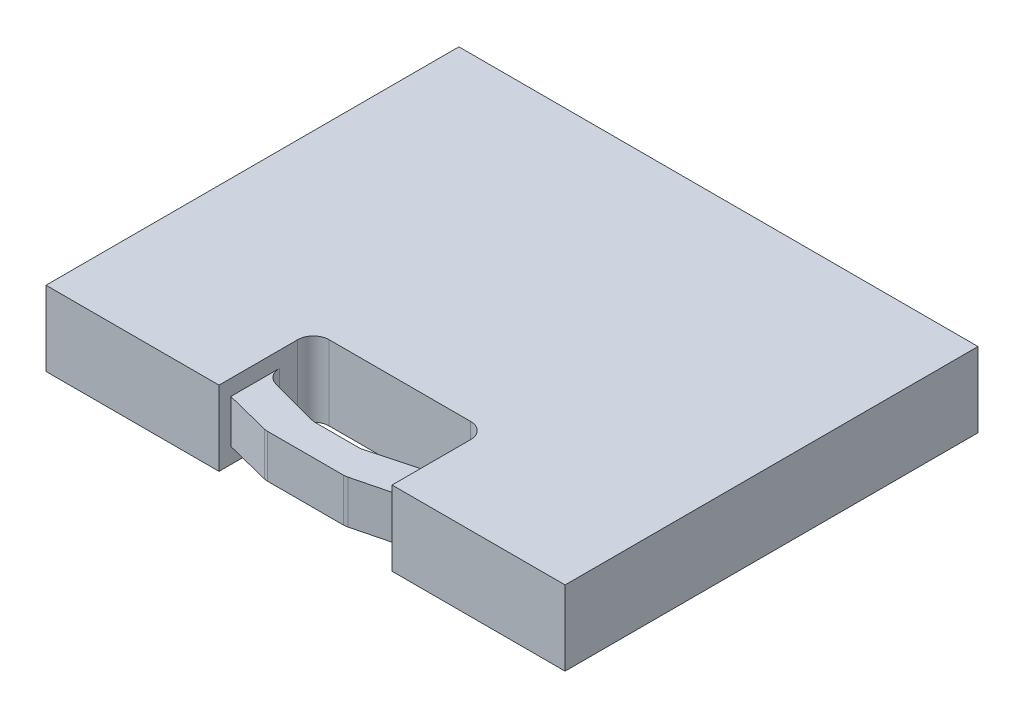
ISO-10303-21;
HEADER;
FILE_DESCRIPTION(('STEP AP214'),'2;1');
FILE_NAME('part.step','',(''),(''),'','','');
FILE_SCHEMA(('AUTOMOTIVE_DESIGN { 1 0 10303 214 1 1 1 1 }'));
ENDSEC;
DATA;
#1=APPLICATION_CONTEXT('core data for automotive mechanical design processes');
#2=APPLICATION_PROTOCOL_DEFINITION('international standard','automotive_design',2000,#1);
#3=PRODUCT_CONTEXT('',#1,'mechanical');
#4=PRODUCT('Part','Part','',(#3));
#5=PRODUCT_RELATED_PRODUCT_CATEGORY('part','',(#4));
#6=PRODUCT_DEFINITION_FORMATION('','',#4);
#7=PRODUCT_DEFINITION_CONTEXT('part definition',#1,'design');
#8=PRODUCT_DEFINITION('design','',#6,#7);
#9=PRODUCT_DEFINITION_SHAPE('','',#8);
#10=(LENGTH_UNIT() NAMED_UNIT(*) SI_UNIT(.MILLI.,.METRE.));
#11=(NAMED_UNIT(*) PLANE_ANGLE_UNIT() SI_UNIT($,.RADIAN.));
#12=(NAMED_UNIT(*) SI_UNIT($,.STERADIAN.) SOLID_ANGLE_UNIT());
#13=UNCERTAINTY_MEASURE_WITH_UNIT(LENGTH_MEASURE(1.E-05),#10,'distance_accuracy_value','');
#14=(GEOMETRIC_REPRESENTATION_CONTEXT(3) GLOBAL_UNCERTAINTY_ASSIGNED_CONTEXT((#13)) GLOBAL_UNIT_ASSIGNED_CONTEXT((#10,
#11,#12)) REPRESENTATION_CONTEXT('',''));
#15=CARTESIAN_POINT('',(0.,0.,0.));
#16=DIRECTION('',(0.,0.,1.));
#17=DIRECTION('',(1.,0.,0.));
#18=AXIS2_PLACEMENT_3D('',#15,#16,#17);
#19=CARTESIAN_POINT('',(-209.55,60.325,166.6875));
#20=DIRECTION('',(0.,0.,-1.));
#21=DIRECTION('',(-1.,0.,0.));
#22=AXIS2_PLACEMENT_3D('',#19,#20,#21);
#23=PLANE('',#22);
#24=DIRECTION('',(-1.,0.,0.));
#25=VECTOR('',#24,1.);
#26=CARTESIAN_POINT('',(-69.85,12.7,166.6875));
#27=LINE('',#26,#25);
#28=CARTESIAN_POINT('',(30.5887182557428,12.7,166.6875));
#29=VERTEX_POINT('',#28);
#30=CARTESIAN_POINT('',(-30.588718255743,12.7,166.6875));
#31=VERTEX_POINT('',#30);
#32=EDGE_CURVE('E660',#29,#31,#27,.T.);
#33=ORIENTED_EDGE('',*,*,#32,.F.);
#34=DIRECTION('',(0.,1.,0.));
#35=VECTOR('',#34,1.);
#36=CARTESIAN_POINT('',(30.5887182557428,60.325,166.6875));
#37=LINE('',#36,#35);
#38=CARTESIAN_POINT('',(30.5887182557428,47.625,166.6875));
#39=VERTEX_POINT('',#38);
#40=EDGE_CURVE('E273',#29,#39,#37,.T.);
#41=ORIENTED_EDGE('',*,*,#40,.T.);
#42=DIRECTION('',(1.,0.,0.));
#43=VECTOR('',#42,1.);
#44=CARTESIAN_POINT('',(-69.85,47.625,166.6875));
#45=LINE('',#44,#43);
#46=CARTESIAN_POINT('',(-30.588718255743,47.625,166.6875));
#47=VERTEX_POINT('',#46);
#48=EDGE_CURVE('E325',#47,#39,#45,.T.);
#49=ORIENTED_EDGE('',*,*,#48,.F.);
#50=DIRECTION('',(0.,1.,0.));
#51=VECTOR('',#50,1.);
#52=CARTESIAN_POINT('',(-30.588718255743,60.325,166.6875));
#53=LINE('',#52,#51);
#54=EDGE_CURVE('E270',#47,#31,#53,.F.);
#55=ORIENTED_EDGE('',*,*,#54,.T.);
#56=EDGE_LOOP('',(#33,#41,#49,#55));
#57=FACE_BOUND('',#56,.T.);
#58=ADVANCED_FACE('F32',(#57),#23,.F.);
#59=CARTESIAN_POINT('',(69.85,0.,157.1625));
#60=DIRECTION('',(-0.245071510184318,0.,-0.969505005090731));
#61=DIRECTION('',(-0.969505005090731,0.,0.245071510184318));
#62=AXIS2_PLACEMENT_3D('',#59,#60,#61);
#63=PLANE('',#62);
#64=DIRECTION('',(-0.969505005090731,0.,0.245071510184318));
#65=VECTOR('',#64,1.);
#66=CARTESIAN_POINT('',(69.85,12.7,157.1625));
#67=LINE('',#66,#65);
#68=CARTESIAN_POINT('',(69.85,12.7,157.1625));
#69=VERTEX_POINT('',#68);
#70=CARTESIAN_POINT('',(33.7011264350836,12.7,166.300213564652));
#71=VERTEX_POINT('',#70);
#72=EDGE_CURVE('E326',#69,#71,#67,.T.);
#73=ORIENTED_EDGE('',*,*,#72,.F.);
#74=DIRECTION('',(0.,1.,0.));
#75=VECTOR('',#74,1.);
#76=CARTESIAN_POINT('',(69.85,0.,157.1625));
#77=LINE('',#76,#75);
#78=CARTESIAN_POINT('',(69.8500000000001,47.625,157.1625));
#79=VERTEX_POINT('',#78);
#80=EDGE_CURVE('E228',#69,#79,#77,.T.);
#81=ORIENTED_EDGE('',*,*,#80,.T.);
#82=DIRECTION('',(-0.969505005090731,0.,0.245071510184318));
#83=VECTOR('',#82,1.);
#84=CARTESIAN_POINT('',(69.85,47.625,157.1625));
#85=LINE('',#84,#83);
#86=CARTESIAN_POINT('',(33.7011264350836,47.625,166.300213564652));
#87=VERTEX_POINT('',#86);
#88=EDGE_CURVE('E231',#79,#87,#85,.T.);
#89=ORIENTED_EDGE('',*,*,#88,.T.);
#90=DIRECTION('',(0.,1.,0.));
#91=VECTOR('',#90,1.);
#92=CARTESIAN_POINT('',(33.7011264350836,0.,166.300213564652));
#93=LINE('',#92,#91);
#94=EDGE_CURVE('E275',#87,#71,#93,.F.);
#95=ORIENTED_EDGE('',*,*,#94,.T.);
#96=EDGE_LOOP('',(#73,#81,#89,#95));
#97=FACE_BOUND('',#96,.T.);
#98=ADVANCED_FACE('F415',(#97),#63,.F.);
#99=CARTESIAN_POINT('',(-69.85,0.,157.1625));
#100=DIRECTION('',(0.245071510184315,0.,-0.969505005090731));
#101=DIRECTION('',(-0.969505005090731,0.,-0.245071510184316));
#102=AXIS2_PLACEMENT_3D('',#99,#100,#101);
#103=PLANE('',#102);
#104=DIRECTION('',(-0.969505005090731,0.,-0.245071510184316));
#105=VECTOR('',#104,1.);
#106=CARTESIAN_POINT('',(-69.85,12.7,157.1625));
#107=LINE('',#106,#105);
#108=CARTESIAN_POINT('',(-33.7011264350838,12.7,166.300213564652));
#109=VERTEX_POINT('',#108);
#110=CARTESIAN_POINT('',(-69.85,12.7,157.1625));
#111=VERTEX_POINT('',#110);
#112=EDGE_CURVE('E192',#109,#111,#107,.T.);
#113=ORIENTED_EDGE('',*,*,#112,.F.);
#114=DIRECTION('',(0.,1.,0.));
#115=VECTOR('',#114,1.);
#116=CARTESIAN_POINT('',(-33.7011264350838,0.,166.300213564652));
#117=LINE('',#116,#115);
#118=CARTESIAN_POINT('',(-33.7011264350838,47.625,166.300213564652));
#119=VERTEX_POINT('',#118);
#120=EDGE_CURVE('E278',#109,#119,#117,.T.);
#121=ORIENTED_EDGE('',*,*,#120,.T.);
#122=DIRECTION('',(-0.969505005090731,0.,-0.245071510184316));
#123=VECTOR('',#122,1.);
#124=CARTESIAN_POINT('',(-69.85,47.625,157.1625));
#125=LINE('',#124,#123);
#126=CARTESIAN_POINT('',(-69.85,47.625,157.1625));
#127=VERTEX_POINT('',#126);
#128=EDGE_CURVE('E215',#119,#127,#125,.T.);
#129=ORIENTED_EDGE('',*,*,#128,.T.);
#130=DIRECTION('',(0.,1.,0.));
#131=VECTOR('',#130,1.);
#132=CARTESIAN_POINT('',(-69.85,0.,157.1625));
#133=LINE('',#132,#131);
#134=EDGE_CURVE('E206',#111,#127,#133,.T.);
#135=ORIENTED_EDGE('',*,*,#134,.F.);
#136=EDGE_LOOP('',(#113,#121,#129,#135));
#137=FACE_BOUND('',#136,.T.);
#138=ADVANCED_FACE('F213',(#137),#103,.F.);
#139=CARTESIAN_POINT('',(-69.85,0.,141.2875));
#140=DIRECTION('',(0.,0.,1.));
#141=DIRECTION('',(1.,0.,0.));
#142=AXIS2_PLACEMENT_3D('',#139,#140,#141);
#143=PLANE('',#142);
#144=DIRECTION('',(1.,0.,0.));
#145=VECTOR('',#144,1.);
#146=CARTESIAN_POINT('',(-69.85,12.7,141.2875));
#147=LINE('',#146,#145);
#148=CARTESIAN_POINT('',(-17.3780132806406,12.7,141.2875));
#149=VERTEX_POINT('',#148);
#150=CARTESIAN_POINT('',(17.3780132806408,12.7,141.2875));
#151=VERTEX_POINT('',#150);
#152=EDGE_CURVE('E649',#149,#151,#147,.T.);
#153=ORIENTED_EDGE('',*,*,#152,.F.);
#154=DIRECTION('',(0.,-1.,0.));
#155=VECTOR('',#154,1.);
#156=CARTESIAN_POINT('',(-17.3780132806406,60.325,141.2875));
#157=LINE('',#156,#155);
#158=CARTESIAN_POINT('',(-17.3780132806406,47.625,141.2875));
#159=VERTEX_POINT('',#158);
#160=EDGE_CURVE('E290',#149,#159,#157,.F.);
#161=ORIENTED_EDGE('',*,*,#160,.T.);
#162=DIRECTION('',(1.,0.,0.));
#163=VECTOR('',#162,1.);
#164=CARTESIAN_POINT('',(-69.85,47.625,141.2875));
#165=LINE('',#164,#163);
#166=CARTESIAN_POINT('',(17.3780132806408,47.625,141.2875));
#167=VERTEX_POINT('',#166);
#168=EDGE_CURVE('E339',#159,#167,#165,.T.);
#169=ORIENTED_EDGE('',*,*,#168,.T.);
#170=DIRECTION('',(0.,1.,0.));
#171=VECTOR('',#170,1.);
#172=CARTESIAN_POINT('',(17.3780132806408,0.,141.2875));
#173=LINE('',#172,#171);
#174=EDGE_CURVE('E292',#167,#151,#173,.F.);
#175=ORIENTED_EDGE('',*,*,#174,.T.);
#176=EDGE_LOOP('',(#153,#161,#169,#175));
#177=FACE_BOUND('',#176,.T.);
#178=ADVANCED_FACE('F437',(#177),#143,.F.);
#179=CARTESIAN_POINT('',(69.85,0.,127.675681024499));
#180=DIRECTION('',(-0.258819045102526,0.,-0.965925826289067));
#181=DIRECTION('',(0.,-1.,0.));
#182=AXIS2_PLACEMENT_3D('',#179,#180,#181);
#183=PLANE('',#182);
#184=DIRECTION('',(-0.965925826289067,0.,0.258819045102526));
#185=VECTOR('',#184,1.);
#186=CARTESIAN_POINT('',(69.85,12.7,127.675681024499));
#187=LINE('',#186,#185);
#188=CARTESIAN_POINT('',(20.6650151534429,12.7,140.854757993871));
#189=VERTEX_POINT('',#188);
#190=CARTESIAN_POINT('',(60.4370018728021,12.7,130.197886271037));
#191=VERTEX_POINT('',#190);
#192=EDGE_CURVE('E667',#189,#191,#187,.F.);
#193=ORIENTED_EDGE('',*,*,#192,.F.);
#194=DIRECTION('',(0.,-1.,0.));
#195=VECTOR('',#194,1.);
#196=CARTESIAN_POINT('',(20.6650151534429,60.325,140.854757993871));
#197=LINE('',#196,#195);
#198=CARTESIAN_POINT('',(20.6650151534429,47.625,140.854757993871));
#199=VERTEX_POINT('',#198);
#200=EDGE_CURVE('E285',#189,#199,#197,.F.);
#201=ORIENTED_EDGE('',*,*,#200,.T.);
#202=DIRECTION('',(-0.965925826289067,0.,0.258819045102526));
#203=VECTOR('',#202,1.);
#204=CARTESIAN_POINT('',(69.85,47.625,127.675681024499));
#205=LINE('',#204,#203);
#206=CARTESIAN_POINT('',(60.4370018728021,47.625,130.197886271037));
#207=VERTEX_POINT('',#206);
#208=EDGE_CURVE('E345',#199,#207,#205,.F.);
#209=ORIENTED_EDGE('',*,*,#208,.T.);
#210=DIRECTION('',(0.,1.,0.));
#211=VECTOR('',#210,1.);
#212=CARTESIAN_POINT('',(60.4370018728021,0.,130.197886271037));
#213=LINE('',#212,#211);
#214=EDGE_CURVE('E287',#207,#191,#213,.F.);
#215=ORIENTED_EDGE('',*,*,#214,.T.);
#216=EDGE_LOOP('',(#193,#201,#209,#215));
#217=FACE_BOUND('',#216,.T.);
#218=ADVANCED_FACE('F433',(#217),#183,.T.);
#219=CARTESIAN_POINT('',(-19.0500000000006,0.,141.2875));
#220=DIRECTION('',(0.258819045102524,0.,-0.965925826289067));
#221=DIRECTION('',(0.,-1.,0.));
#222=AXIS2_PLACEMENT_3D('',#219,#220,#221);
#223=PLANE('',#222);
#224=DIRECTION('',(-0.965925826289067,0.,-0.258819045102524));
#225=VECTOR('',#224,1.);
#226=CARTESIAN_POINT('',(-19.0500000000006,12.7,141.2875));
#227=LINE('',#226,#225);
#228=CARTESIAN_POINT('',(-60.4370018728021,12.7,130.197886271037));
#229=VERTEX_POINT('',#228);
#230=CARTESIAN_POINT('',(-20.6650151534427,12.7,140.854757993871));
#231=VERTEX_POINT('',#230);
#232=EDGE_CURVE('E659',#229,#231,#227,.F.);
#233=ORIENTED_EDGE('',*,*,#232,.F.);
#234=DIRECTION('',(0.,-1.,0.));
#235=VECTOR('',#234,1.);
#236=CARTESIAN_POINT('',(-60.4370018728021,60.325,130.197886271037));
#237=LINE('',#236,#235);
#238=CARTESIAN_POINT('',(-60.4370018728021,47.625,130.197886271037));
#239=VERTEX_POINT('',#238);
#240=EDGE_CURVE('E54',#229,#239,#237,.F.);
#241=ORIENTED_EDGE('',*,*,#240,.T.);
#242=DIRECTION('',(-0.965925826289067,0.,-0.258819045102524));
#243=VECTOR('',#242,1.);
#244=CARTESIAN_POINT('',(-19.0500000000006,47.625,141.2875));
#245=LINE('',#244,#243);
#246=CARTESIAN_POINT('',(-20.6650151534427,47.625,140.854757993871));
#247=VERTEX_POINT('',#246);
#248=EDGE_CURVE('E324',#239,#247,#245,.F.);
#249=ORIENTED_EDGE('',*,*,#248,.T.);
#250=DIRECTION('',(0.,1.,0.));
#251=VECTOR('',#250,1.);
#252=CARTESIAN_POINT('',(-20.6650151534427,0.,140.854757993871));
#253=LINE('',#252,#251);
#254=EDGE_CURVE('E296',#247,#231,#253,.F.);
#255=ORIENTED_EDGE('',*,*,#254,.T.);
#256=EDGE_LOOP('',(#233,#241,#249,#255));
#257=FACE_BOUND('',#256,.T.);
#258=ADVANCED_FACE('F436',(#257),#223,.T.);
#259=CARTESIAN_POINT('',(30.5887182557428,60.325,153.9875));
#260=DIRECTION('',(0.,1.,0.));
#261=DIRECTION('',(0.,0.,1.));
#262=AXIS2_PLACEMENT_3D('',#259,#260,#261);
#263=CYLINDRICAL_SURFACE('',#262,12.7);
#264=ORIENTED_EDGE('',*,*,#40,.F.);
#265=CARTESIAN_POINT('',(30.5887182557428,12.7,153.9875));
#266=DIRECTION('',(0.,-1.,0.));
#267=DIRECTION('',(0.,0.,-1.));
#268=AXIS2_PLACEMENT_3D('',#265,#266,#267);
#269=CIRCLE('',#268,12.7);
#270=EDGE_CURVE('E199',#29,#71,#269,.F.);
#271=ORIENTED_EDGE('',*,*,#270,.T.);
#272=ORIENTED_EDGE('',*,*,#94,.F.);
#273=CARTESIAN_POINT('',(30.5887182557428,47.625,153.9875));
#274=DIRECTION('',(0.,-1.,0.));
#275=DIRECTION('',(0.,0.,-1.));
#276=AXIS2_PLACEMENT_3D('',#273,#274,#275);
#277=CIRCLE('',#276,12.7);
#278=EDGE_CURVE('E354',#39,#87,#277,.F.);
#279=ORIENTED_EDGE('',*,*,#278,.F.);
#280=EDGE_LOOP('',(#264,#271,#272,#279));
#281=FACE_BOUND('',#280,.T.);
#282=ADVANCED_FACE('F441',(#281),#263,.T.);
#283=CARTESIAN_POINT('',(-30.588718255743,0.,153.9875));
#284=DIRECTION('',(0.,1.,0.));
#285=DIRECTION('',(0.,0.,1.));
#286=AXIS2_PLACEMENT_3D('',#283,#284,#285);
#287=CYLINDRICAL_SURFACE('',#286,12.7);
#288=ORIENTED_EDGE('',*,*,#120,.F.);
#289=CARTESIAN_POINT('',(-30.588718255743,12.7,153.9875));
#290=DIRECTION('',(0.,-1.,0.));
#291=DIRECTION('',(0.,0.,-1.));
#292=AXIS2_PLACEMENT_3D('',#289,#290,#291);
#293=CIRCLE('',#292,12.7);
#294=EDGE_CURVE('E195',#109,#31,#293,.F.);
#295=ORIENTED_EDGE('',*,*,#294,.T.);
#296=ORIENTED_EDGE('',*,*,#54,.F.);
#297=CARTESIAN_POINT('',(-30.588718255743,47.625,153.9875));
#298=DIRECTION('',(0.,-1.,0.));
#299=DIRECTION('',(0.,0.,-1.));
#300=AXIS2_PLACEMENT_3D('',#297,#298,#299);
#301=CIRCLE('',#300,12.7);
#302=EDGE_CURVE('E351',#119,#47,#301,.F.);
#303=ORIENTED_EDGE('',*,*,#302,.F.);
#304=EDGE_LOOP('',(#288,#295,#296,#303));
#305=FACE_BOUND('',#304,.T.);
#306=ADVANCED_FACE('F444',(#305),#287,.T.);
#307=CARTESIAN_POINT('',(57.15,0.,117.930628277166));
#308=DIRECTION('',(0.,1.,0.));
#309=DIRECTION('',(0.,0.,1.));
#310=AXIS2_PLACEMENT_3D('',#307,#308,#309);
#311=CYLINDRICAL_SURFACE('',#310,12.7);
#312=CARTESIAN_POINT('',(57.15,12.7,117.930628277166));
#313=DIRECTION('',(0.,-1.,0.));
#314=DIRECTION('',(0.,0.,-1.));
#315=AXIS2_PLACEMENT_3D('',#312,#313,#314);
#316=CIRCLE('',#315,12.7);
#317=CARTESIAN_POINT('',(69.85,12.7,117.930628277166));
#318=VERTEX_POINT('',#317);
#319=EDGE_CURVE('E669',#191,#318,#316,.F.);
#320=ORIENTED_EDGE('',*,*,#319,.F.);
#321=ORIENTED_EDGE('',*,*,#214,.F.);
#322=CARTESIAN_POINT('',(57.15,47.625,117.930628277166));
#323=DIRECTION('',(0.,-1.,0.));
#324=DIRECTION('',(0.,0.,-1.));
#325=AXIS2_PLACEMENT_3D('',#322,#323,#324);
#326=CIRCLE('',#325,12.7);
#327=CARTESIAN_POINT('',(69.8500000000001,47.625,117.930628277166));
#328=VERTEX_POINT('',#327);
#329=EDGE_CURVE('E348',#207,#328,#326,.F.);
#330=ORIENTED_EDGE('',*,*,#329,.T.);
#331=DIRECTION('',(0.,-1.,0.));
#332=VECTOR('',#331,1.);
#333=CARTESIAN_POINT('',(69.85,60.325,117.930628277166));
#334=LINE('',#333,#332);
#335=EDGE_CURVE('E283',#318,#328,#334,.F.);
#336=ORIENTED_EDGE('',*,*,#335,.F.);
#337=EDGE_LOOP('',(#320,#321,#330,#336));
#338=FACE_BOUND('',#337,.T.);
#339=ADVANCED_FACE('F448',(#338),#311,.F.);
#340=CARTESIAN_POINT('',(17.3780132806408,0.,128.5875));
#341=DIRECTION('',(0.,-1.,0.));
#342=DIRECTION('',(0.,0.,-1.));
#343=AXIS2_PLACEMENT_3D('',#340,#341,#342);
#344=CYLINDRICAL_SURFACE('',#343,12.7);
#345=CARTESIAN_POINT('',(17.3780132806408,12.7,128.5875));
#346=DIRECTION('',(0.,-1.,0.));
#347=DIRECTION('',(0.,0.,-1.));
#348=AXIS2_PLACEMENT_3D('',#345,#346,#347);
#349=CIRCLE('',#348,12.7);
#350=EDGE_CURVE('E654',#151,#189,#349,.F.);
#351=ORIENTED_EDGE('',*,*,#350,.F.);
#352=ORIENTED_EDGE('',*,*,#174,.F.);
#353=CARTESIAN_POINT('',(17.3780132806408,47.625,128.5875));
#354=DIRECTION('',(0.,-1.,0.));
#355=DIRECTION('',(0.,0.,-1.));
#356=AXIS2_PLACEMENT_3D('',#353,#354,#355);
#357=CIRCLE('',#356,12.7);
#358=EDGE_CURVE('E342',#167,#199,#357,.F.);
#359=ORIENTED_EDGE('',*,*,#358,.T.);
#360=ORIENTED_EDGE('',*,*,#200,.F.);
#361=EDGE_LOOP('',(#351,#352,#359,#360));
#362=FACE_BOUND('',#361,.T.);
#363=ADVANCED_FACE('F452',(#362),#344,.F.);
#364=CARTESIAN_POINT('',(-17.3780132806406,0.,128.5875));
#365=DIRECTION('',(0.,1.,0.));
#366=DIRECTION('',(0.,0.,1.));
#367=AXIS2_PLACEMENT_3D('',#364,#365,#366);
#368=CYLINDRICAL_SURFACE('',#367,12.7);
#369=CARTESIAN_POINT('',(-17.3780132806406,12.7,128.5875));
#370=DIRECTION('',(0.,-1.,0.));
#371=DIRECTION('',(0.,0.,-1.));
#372=AXIS2_PLACEMENT_3D('',#369,#370,#371);
#373=CIRCLE('',#372,12.7);
#374=EDGE_CURVE('E655',#231,#149,#373,.F.);
#375=ORIENTED_EDGE('',*,*,#374,.F.);
#376=ORIENTED_EDGE('',*,*,#254,.F.);
#377=CARTESIAN_POINT('',(-17.3780132806406,47.625,128.5875));
#378=DIRECTION('',(0.,-1.,0.));
#379=DIRECTION('',(0.,0.,-1.));
#380=AXIS2_PLACEMENT_3D('',#377,#378,#379);
#381=CIRCLE('',#380,12.7);
#382=EDGE_CURVE('E336',#247,#159,#381,.F.);
#383=ORIENTED_EDGE('',*,*,#382,.T.);
#384=ORIENTED_EDGE('',*,*,#160,.F.);
#385=EDGE_LOOP('',(#375,#376,#383,#384));
#386=FACE_BOUND('',#385,.T.);
#387=ADVANCED_FACE('F456',(#386),#368,.F.);
#388=CARTESIAN_POINT('',(-57.15,0.,117.930628277166));
#389=DIRECTION('',(0.,-1.,0.));
#390=DIRECTION('',(0.,0.,-1.));
#391=AXIS2_PLACEMENT_3D('',#388,#389,#390);
#392=CYLINDRICAL_SURFACE('',#391,12.7);
#393=CARTESIAN_POINT('',(-57.15,12.7,117.930628277166));
#394=DIRECTION('',(0.,-1.,0.));
#395=DIRECTION('',(0.,0.,-1.));
#396=AXIS2_PLACEMENT_3D('',#393,#394,#395);
#397=CIRCLE('',#396,12.7);
#398=CARTESIAN_POINT('',(-69.85,12.7,117.930628277166));
#399=VERTEX_POINT('',#398);
#400=EDGE_CURVE('E11',#399,#229,#397,.F.);
#401=ORIENTED_EDGE('',*,*,#400,.F.);
#402=DIRECTION('',(0.,1.,0.));
#403=VECTOR('',#402,1.);
#404=CARTESIAN_POINT('',(-69.85,0.,117.930628277166));
#405=LINE('',#404,#403);
#406=CARTESIAN_POINT('',(-69.85,47.625,117.930628277166));
#407=VERTEX_POINT('',#406);
#408=EDGE_CURVE('E209',#407,#399,#405,.F.);
#409=ORIENTED_EDGE('',*,*,#408,.F.);
#410=CARTESIAN_POINT('',(-57.15,47.625,117.930628277166));
#411=DIRECTION('',(0.,-1.,0.));
#412=DIRECTION('',(0.,0.,-1.));
#413=AXIS2_PLACEMENT_3D('',#410,#411,#412);
#414=CIRCLE('',#413,12.7);
#415=EDGE_CURVE('E40',#407,#239,#414,.F.);
#416=ORIENTED_EDGE('',*,*,#415,.T.);
#417=ORIENTED_EDGE('',*,*,#240,.F.);
#418=EDGE_LOOP('',(#401,#409,#416,#417));
#419=FACE_BOUND('',#418,.T.);
#420=ADVANCED_FACE('F319',(#419),#392,.F.);
#421=DIRECTION('',(1.,0.,0.));
#422=VECTOR('',#421,1.);
#423=CARTESIAN_POINT('',(-209.55,0.,166.6875));
#424=LINE('',#423,#422);
#425=CARTESIAN_POINT('',(-209.55,0.,166.6875));
#426=VERTEX_POINT('',#425);
#427=CARTESIAN_POINT('',(-69.85,0.,166.6875));
#428=VERTEX_POINT('',#427);
#429=EDGE_CURVE('E239',#426,#428,#424,.T.);
#430=ORIENTED_EDGE('',*,*,#429,.T.);
#431=DIRECTION('',(0.,1.,0.));
#432=VECTOR('',#431,1.);
#433=CARTESIAN_POINT('',(-69.85,0.,166.6875));
#434=LINE('',#433,#432);
#435=CARTESIAN_POINT('',(-69.85,60.325,166.6875));
#436=VERTEX_POINT('',#435);
#437=EDGE_CURVE('E216',#428,#436,#434,.T.);
#438=ORIENTED_EDGE('',*,*,#437,.T.);
#439=DIRECTION('',(1.,0.,0.));
#440=VECTOR('',#439,1.);
#441=CARTESIAN_POINT('',(-209.55,60.325,166.6875));
#442=LINE('',#441,#440);
#443=CARTESIAN_POINT('',(-209.55,60.325,166.6875));
#444=VERTEX_POINT('',#443);
#445=EDGE_CURVE('E244',#444,#436,#442,.T.);
#446=ORIENTED_EDGE('',*,*,#445,.F.);
#447=DIRECTION('',(0.,-1.,0.));
#448=VECTOR('',#447,1.);
#449=CARTESIAN_POINT('',(-209.55,60.325,166.6875));
#450=LINE('',#449,#448);
#451=EDGE_CURVE('E261',#444,#426,#450,.T.);
#452=ORIENTED_EDGE('',*,*,#451,.T.);
#453=EDGE_LOOP('',(#430,#438,#446,#452));
#454=FACE_BOUND('',#453,.T.);
#455=ADVANCED_FACE('F370',(#454),#23,.F.);
#456=CARTESIAN_POINT('',(69.8500000000001,60.325,166.6875));
#457=VERTEX_POINT('',#456);
#458=CARTESIAN_POINT('',(209.55,60.325,166.6875));
#459=VERTEX_POINT('',#458);
#460=EDGE_CURVE('E243',#457,#459,#442,.T.);
#461=ORIENTED_EDGE('',*,*,#460,.F.);
#462=DIRECTION('',(0.,1.,0.));
#463=VECTOR('',#462,1.);
#464=CARTESIAN_POINT('',(69.8500000000001,0.,166.6875));
#465=LINE('',#464,#463);
#466=CARTESIAN_POINT('',(69.8500000000001,0.,166.6875));
#467=VERTEX_POINT('',#466);
#468=EDGE_CURVE('E232',#467,#457,#465,.T.);
#469=ORIENTED_EDGE('',*,*,#468,.F.);
#470=CARTESIAN_POINT('',(209.55,0.,166.6875));
#471=VERTEX_POINT('',#470);
#472=EDGE_CURVE('E256',#467,#471,#424,.T.);
#473=ORIENTED_EDGE('',*,*,#472,.T.);
#474=DIRECTION('',(0.,-1.,0.));
#475=VECTOR('',#474,1.);
#476=CARTESIAN_POINT('',(209.55,60.325,166.6875));
#477=LINE('',#476,#475);
#478=EDGE_CURVE('E247',#459,#471,#477,.T.);
#479=ORIENTED_EDGE('',*,*,#478,.F.);
#480=EDGE_LOOP('',(#461,#469,#473,#479));
#481=FACE_BOUND('',#480,.T.);
#482=ADVANCED_FACE('F393',(#481),#23,.F.);
#483=CARTESIAN_POINT('',(209.55,60.325,166.6875));
#484=DIRECTION('',(-1.,0.,0.));
#485=DIRECTION('',(0.,0.,1.));
#486=AXIS2_PLACEMENT_3D('',#483,#484,#485);
#487=PLANE('',#486);
#488=DIRECTION('',(0.,0.,-1.));
#489=VECTOR('',#488,1.);
#490=CARTESIAN_POINT('',(209.55,0.,166.6875));
#491=LINE('',#490,#489);
#492=CARTESIAN_POINT('',(209.55,0.,-166.6875));
#493=VERTEX_POINT('',#492);
#494=EDGE_CURVE('E248',#471,#493,#491,.T.);
#495=ORIENTED_EDGE('',*,*,#494,.T.);
#496=DIRECTION('',(0.,-1.,0.));
#497=VECTOR('',#496,1.);
#498=CARTESIAN_POINT('',(209.55,60.325,-166.6875));
#499=LINE('',#498,#497);
#500=CARTESIAN_POINT('',(209.55,60.325,-166.6875));
#501=VERTEX_POINT('',#500);
#502=EDGE_CURVE('E267',#501,#493,#499,.T.);
#503=ORIENTED_EDGE('',*,*,#502,.F.);
#504=DIRECTION('',(0.,0.,-1.));
#505=VECTOR('',#504,1.);
#506=CARTESIAN_POINT('',(209.55,60.325,166.6875));
#507=LINE('',#506,#505);
#508=EDGE_CURVE('E235',#459,#501,#507,.T.);
#509=ORIENTED_EDGE('',*,*,#508,.F.);
#510=ORIENTED_EDGE('',*,*,#478,.T.);
#511=EDGE_LOOP('',(#495,#503,#509,#510));
#512=FACE_BOUND('',#511,.T.);
#513=ADVANCED_FACE('F399',(#512),#487,.F.);
#514=CARTESIAN_POINT('',(-209.55,60.325,-166.6875));
#515=DIRECTION('',(0.,0.,1.));
#516=DIRECTION('',(1.,0.,0.));
#517=AXIS2_PLACEMENT_3D('',#514,#515,#516);
#518=PLANE('',#517);
#519=DIRECTION('',(-1.,0.,0.));
#520=VECTOR('',#519,1.);
#521=CARTESIAN_POINT('',(-209.55,0.,-166.6875));
#522=LINE('',#521,#520);
#523=CARTESIAN_POINT('',(-209.55,0.,-166.6875));
#524=VERTEX_POINT('',#523);
#525=EDGE_CURVE('E251',#493,#524,#522,.T.);
#526=ORIENTED_EDGE('',*,*,#525,.T.);
#527=DIRECTION('',(0.,-1.,0.));
#528=VECTOR('',#527,1.);
#529=CARTESIAN_POINT('',(-209.55,60.325,-166.6875));
#530=LINE('',#529,#528);
#531=CARTESIAN_POINT('',(-209.55,60.325,-166.6875));
#532=VERTEX_POINT('',#531);
#533=EDGE_CURVE('E264',#532,#524,#530,.T.);
#534=ORIENTED_EDGE('',*,*,#533,.F.);
#535=DIRECTION('',(-1.,0.,0.));
#536=VECTOR('',#535,1.);
#537=CARTESIAN_POINT('',(-209.55,60.325,-166.6875));
#538=LINE('',#537,#536);
#539=EDGE_CURVE('E238',#501,#532,#538,.T.);
#540=ORIENTED_EDGE('',*,*,#539,.F.);
#541=ORIENTED_EDGE('',*,*,#502,.T.);
#542=EDGE_LOOP('',(#526,#534,#540,#541));
#543=FACE_BOUND('',#542,.T.);
#544=ADVANCED_FACE('F402',(#543),#518,.F.);
#545=CARTESIAN_POINT('',(-209.55,60.325,166.6875));
#546=DIRECTION('',(1.,0.,0.));
#547=DIRECTION('',(0.,0.,-1.));
#548=AXIS2_PLACEMENT_3D('',#545,#546,#547);
#549=PLANE('',#548);
#550=DIRECTION('',(0.,0.,1.));
#551=VECTOR('',#550,1.);
#552=CARTESIAN_POINT('',(-209.55,0.,166.6875));
#553=LINE('',#552,#551);
#554=EDGE_CURVE('E254',#524,#426,#553,.T.);
#555=ORIENTED_EDGE('',*,*,#554,.T.);
#556=ORIENTED_EDGE('',*,*,#451,.F.);
#557=DIRECTION('',(0.,0.,1.));
#558=VECTOR('',#557,1.);
#559=CARTESIAN_POINT('',(-209.55,60.325,166.6875));
#560=LINE('',#559,#558);
#561=EDGE_CURVE('E241',#532,#444,#560,.T.);
#562=ORIENTED_EDGE('',*,*,#561,.F.);
#563=ORIENTED_EDGE('',*,*,#533,.T.);
#564=EDGE_LOOP('',(#555,#556,#562,#563));
#565=FACE_BOUND('',#564,.T.);
#566=ADVANCED_FACE('F404',(#565),#549,.F.);
#567=CARTESIAN_POINT('',(0.,60.325,0.));
#568=DIRECTION('',(0.,-1.,0.));
#569=DIRECTION('',(0.,0.,-1.));
#570=AXIS2_PLACEMENT_3D('',#567,#568,#569);
#571=PLANE('',#570);
#572=DIRECTION('',(0.,0.,1.));
#573=VECTOR('',#572,1.);
#574=CARTESIAN_POINT('',(-69.85,60.325,166.6875));
#575=LINE('',#574,#573);
#576=CARTESIAN_POINT('',(-69.85,60.325,103.1875));
#577=VERTEX_POINT('',#576);
#578=EDGE_CURVE('E222',#577,#436,#575,.T.);
#579=ORIENTED_EDGE('',*,*,#578,.F.);
#580=CARTESIAN_POINT('',(-57.15,60.325,103.1875));
#581=DIRECTION('',(0.,-1.,0.));
#582=DIRECTION('',(0.,0.,-1.));
#583=AXIS2_PLACEMENT_3D('',#580,#581,#582);
#584=CIRCLE('',#583,12.7);
#585=CARTESIAN_POINT('',(-57.15,60.325,90.4875));
#586=VERTEX_POINT('',#585);
#587=EDGE_CURVE('E313',#577,#586,#584,.T.);
#588=ORIENTED_EDGE('',*,*,#587,.T.);
#589=DIRECTION('',(-1.,0.,0.));
#590=VECTOR('',#589,1.);
#591=CARTESIAN_POINT('',(-69.85,60.325,90.4875));
#592=LINE('',#591,#590);
#593=CARTESIAN_POINT('',(57.15,60.325,90.4875));
#594=VERTEX_POINT('',#593);
#595=EDGE_CURVE('E219',#594,#586,#592,.T.);
#596=ORIENTED_EDGE('',*,*,#595,.F.);
#597=CARTESIAN_POINT('',(57.15,60.325,103.1875));
#598=DIRECTION('',(0.,-1.,0.));
#599=DIRECTION('',(0.,0.,-1.));
#600=AXIS2_PLACEMENT_3D('',#597,#598,#599);
#601=CIRCLE('',#600,12.7);
#602=CARTESIAN_POINT('',(69.85,60.325,103.1875));
#603=VERTEX_POINT('',#602);
#604=EDGE_CURVE('E308',#594,#603,#601,.T.);
#605=ORIENTED_EDGE('',*,*,#604,.T.);
#606=DIRECTION('',(0.,0.,-1.));
#607=VECTOR('',#606,1.);
#608=CARTESIAN_POINT('',(69.8500000000001,60.325,166.6875));
#609=LINE('',#608,#607);
#610=EDGE_CURVE('E229',#457,#603,#609,.T.);
#611=ORIENTED_EDGE('',*,*,#610,.F.);
#612=ORIENTED_EDGE('',*,*,#460,.T.);
#613=ORIENTED_EDGE('',*,*,#508,.T.);
#614=ORIENTED_EDGE('',*,*,#539,.T.);
#615=ORIENTED_EDGE('',*,*,#561,.T.);
#616=ORIENTED_EDGE('',*,*,#445,.T.);
#617=EDGE_LOOP('',(#579,#588,#596,#605,#611,#612,#613,#614,#615,#616));
#618=FACE_BOUND('',#617,.T.);
#619=ADVANCED_FACE('F366',(#618),#571,.F.);
#620=CARTESIAN_POINT('',(0.,0.,0.));
#621=DIRECTION('',(0.,-1.,0.));
#622=DIRECTION('',(0.,0.,-1.));
#623=AXIS2_PLACEMENT_3D('',#620,#621,#622);
#624=PLANE('',#623);
#625=CARTESIAN_POINT('',(-57.15,0.,103.1875));
#626=DIRECTION('',(0.,-1.,0.));
#627=DIRECTION('',(0.,0.,-1.));
#628=AXIS2_PLACEMENT_3D('',#625,#626,#627);
#629=CIRCLE('',#628,12.7);
#630=CARTESIAN_POINT('',(-57.15,0.,90.4875));
#631=VERTEX_POINT('',#630);
#632=CARTESIAN_POINT('',(-69.85,0.,103.1875));
#633=VERTEX_POINT('',#632);
#634=EDGE_CURVE('E315',#631,#633,#629,.F.);
#635=ORIENTED_EDGE('',*,*,#634,.T.);
#636=DIRECTION('',(0.,0.,1.));
#637=VECTOR('',#636,1.);
#638=CARTESIAN_POINT('',(-69.85,0.,166.6875));
#639=LINE('',#638,#637);
#640=EDGE_CURVE('E217',#633,#428,#639,.T.);
#641=ORIENTED_EDGE('',*,*,#640,.T.);
#642=ORIENTED_EDGE('',*,*,#429,.F.);
#643=ORIENTED_EDGE('',*,*,#554,.F.);
#644=ORIENTED_EDGE('',*,*,#525,.F.);
#645=ORIENTED_EDGE('',*,*,#494,.F.);
#646=ORIENTED_EDGE('',*,*,#472,.F.);
#647=DIRECTION('',(0.,0.,-1.));
#648=VECTOR('',#647,1.);
#649=CARTESIAN_POINT('',(69.8500000000001,0.,166.6875));
#650=LINE('',#649,#648);
#651=CARTESIAN_POINT('',(69.85,0.,103.1875));
#652=VERTEX_POINT('',#651);
#653=EDGE_CURVE('E226',#467,#652,#650,.T.);
#654=ORIENTED_EDGE('',*,*,#653,.T.);
#655=CARTESIAN_POINT('',(57.15,0.,103.1875));
#656=DIRECTION('',(0.,-1.,0.));
#657=DIRECTION('',(0.,0.,-1.));
#658=AXIS2_PLACEMENT_3D('',#655,#656,#657);
#659=CIRCLE('',#658,12.7);
#660=CARTESIAN_POINT('',(57.15,0.,90.4875));
#661=VERTEX_POINT('',#660);
#662=EDGE_CURVE('E311',#652,#661,#659,.F.);
#663=ORIENTED_EDGE('',*,*,#662,.T.);
#664=DIRECTION('',(-1.,0.,0.));
#665=VECTOR('',#664,1.);
#666=CARTESIAN_POINT('',(-69.85,0.,90.4875));
#667=LINE('',#666,#665);
#668=EDGE_CURVE('E252',#661,#631,#667,.T.);
#669=ORIENTED_EDGE('',*,*,#668,.T.);
#670=EDGE_LOOP('',(#635,#641,#642,#643,#644,#645,#646,#654,#663,#669));
#671=FACE_BOUND('',#670,.T.);
#672=ADVANCED_FACE('F374',(#671),#624,.T.);
#673=CARTESIAN_POINT('',(69.85,0.,141.2875));
#674=DIRECTION('',(1.,0.,0.));
#675=DIRECTION('',(0.,0.,-1.));
#676=AXIS2_PLACEMENT_3D('',#673,#674,#675);
#677=PLANE('',#676);
#678=ORIENTED_EDGE('',*,*,#80,.F.);
#679=DIRECTION('',(0.,0.,1.));
#680=VECTOR('',#679,1.);
#681=CARTESIAN_POINT('',(69.85,12.7,166.6875));
#682=LINE('',#681,#680);
#683=EDGE_CURVE('E210',#318,#69,#682,.T.);
#684=ORIENTED_EDGE('',*,*,#683,.F.);
#685=ORIENTED_EDGE('',*,*,#335,.T.);
#686=DIRECTION('',(0.,0.,-1.));
#687=VECTOR('',#686,1.);
#688=CARTESIAN_POINT('',(69.8500000000001,47.625,166.6875));
#689=LINE('',#688,#687);
#690=EDGE_CURVE('E329',#79,#328,#689,.T.);
#691=ORIENTED_EDGE('',*,*,#690,.F.);
#692=EDGE_LOOP('',(#678,#684,#685,#691));
#693=FACE_BOUND('',#692,.T.);
#694=ORIENTED_EDGE('',*,*,#468,.T.);
#695=ORIENTED_EDGE('',*,*,#610,.T.);
#696=DIRECTION('',(0.,1.,0.));
#697=VECTOR('',#696,1.);
#698=CARTESIAN_POINT('',(69.85,0.,103.1875));
#699=LINE('',#698,#697);
#700=EDGE_CURVE('E280',#603,#652,#699,.F.);
#701=ORIENTED_EDGE('',*,*,#700,.T.);
#702=ORIENTED_EDGE('',*,*,#653,.F.);
#703=EDGE_LOOP('',(#694,#695,#701,#702));
#704=FACE_BOUND('',#703,.T.);
#705=ADVANCED_FACE('F471',(#693,#704),#677,.F.);
#706=CARTESIAN_POINT('',(-69.85,0.,141.2875));
#707=DIRECTION('',(-1.,0.,0.));
#708=DIRECTION('',(0.,0.,1.));
#709=AXIS2_PLACEMENT_3D('',#706,#707,#708);
#710=PLANE('',#709);
#711=DIRECTION('',(0.,0.,-1.));
#712=VECTOR('',#711,1.);
#713=CARTESIAN_POINT('',(-69.85,12.7,166.6875));
#714=LINE('',#713,#712);
#715=EDGE_CURVE('E46',#111,#399,#714,.T.);
#716=ORIENTED_EDGE('',*,*,#715,.F.);
#717=ORIENTED_EDGE('',*,*,#134,.T.);
#718=DIRECTION('',(0.,0.,1.));
#719=VECTOR('',#718,1.);
#720=CARTESIAN_POINT('',(-69.85,47.625,166.6875));
#721=LINE('',#720,#719);
#722=EDGE_CURVE('E323',#407,#127,#721,.T.);
#723=ORIENTED_EDGE('',*,*,#722,.F.);
#724=ORIENTED_EDGE('',*,*,#408,.T.);
#725=EDGE_LOOP('',(#716,#717,#723,#724));
#726=FACE_BOUND('',#725,.T.);
#727=ORIENTED_EDGE('',*,*,#640,.F.);
#728=DIRECTION('',(0.,1.,0.));
#729=VECTOR('',#728,1.);
#730=CARTESIAN_POINT('',(-69.85,60.325,103.1875));
#731=LINE('',#730,#729);
#732=EDGE_CURVE('E299',#633,#577,#731,.T.);
#733=ORIENTED_EDGE('',*,*,#732,.T.);
#734=ORIENTED_EDGE('',*,*,#578,.T.);
#735=ORIENTED_EDGE('',*,*,#437,.F.);
#736=EDGE_LOOP('',(#727,#733,#734,#735));
#737=FACE_BOUND('',#736,.T.);
#738=ADVANCED_FACE('F203',(#726,#737),#710,.F.);
#739=CARTESIAN_POINT('',(-69.85,0.,90.4875));
#740=DIRECTION('',(0.,0.,-1.));
#741=DIRECTION('',(-1.,0.,0.));
#742=AXIS2_PLACEMENT_3D('',#739,#740,#741);
#743=PLANE('',#742);
#744=ORIENTED_EDGE('',*,*,#668,.F.);
#745=DIRECTION('',(0.,1.,0.));
#746=VECTOR('',#745,1.);
#747=CARTESIAN_POINT('',(57.15,60.325,90.4875));
#748=LINE('',#747,#746);
#749=EDGE_CURVE('E305',#661,#594,#748,.T.);
#750=ORIENTED_EDGE('',*,*,#749,.T.);
#751=ORIENTED_EDGE('',*,*,#595,.T.);
#752=DIRECTION('',(0.,1.,0.));
#753=VECTOR('',#752,1.);
#754=CARTESIAN_POINT('',(-57.15,0.,90.4875));
#755=LINE('',#754,#753);
#756=EDGE_CURVE('E303',#586,#631,#755,.F.);
#757=ORIENTED_EDGE('',*,*,#756,.T.);
#758=EDGE_LOOP('',(#744,#750,#751,#757));
#759=FACE_BOUND('',#758,.T.);
#760=ADVANCED_FACE('F381',(#759),#743,.F.);
#761=CARTESIAN_POINT('',(57.15,0.,103.1875));
#762=DIRECTION('',(0.,-1.,0.));
#763=DIRECTION('',(0.,0.,-1.));
#764=AXIS2_PLACEMENT_3D('',#761,#762,#763);
#765=CYLINDRICAL_SURFACE('',#764,12.7);
#766=ORIENTED_EDGE('',*,*,#662,.F.);
#767=ORIENTED_EDGE('',*,*,#700,.F.);
#768=ORIENTED_EDGE('',*,*,#604,.F.);
#769=ORIENTED_EDGE('',*,*,#749,.F.);
#770=EDGE_LOOP('',(#766,#767,#768,#769));
#771=FACE_BOUND('',#770,.T.);
#772=ADVANCED_FACE('F385',(#771),#765,.F.);
#773=CARTESIAN_POINT('',(-57.15,0.,103.1875));
#774=DIRECTION('',(0.,-1.,0.));
#775=DIRECTION('',(0.,0.,-1.));
#776=AXIS2_PLACEMENT_3D('',#773,#774,#775);
#777=CYLINDRICAL_SURFACE('',#776,12.7);
#778=ORIENTED_EDGE('',*,*,#634,.F.);
#779=ORIENTED_EDGE('',*,*,#756,.F.);
#780=ORIENTED_EDGE('',*,*,#587,.F.);
#781=ORIENTED_EDGE('',*,*,#732,.F.);
#782=EDGE_LOOP('',(#778,#779,#780,#781));
#783=FACE_BOUND('',#782,.T.);
#784=ADVANCED_FACE('F34',(#783),#777,.F.);
#785=CARTESIAN_POINT('',(0.,47.625,0.));
#786=DIRECTION('',(0.,-1.,0.));
#787=DIRECTION('',(0.,0.,-1.));
#788=AXIS2_PLACEMENT_3D('',#785,#786,#787);
#789=PLANE('',#788);
#790=ORIENTED_EDGE('',*,*,#690,.T.);
#791=ORIENTED_EDGE('',*,*,#329,.F.);
#792=ORIENTED_EDGE('',*,*,#208,.F.);
#793=ORIENTED_EDGE('',*,*,#358,.F.);
#794=ORIENTED_EDGE('',*,*,#168,.F.);
#795=ORIENTED_EDGE('',*,*,#382,.F.);
#796=ORIENTED_EDGE('',*,*,#248,.F.);
#797=ORIENTED_EDGE('',*,*,#415,.F.);
#798=ORIENTED_EDGE('',*,*,#722,.T.);
#799=ORIENTED_EDGE('',*,*,#128,.F.);
#800=ORIENTED_EDGE('',*,*,#302,.T.);
#801=ORIENTED_EDGE('',*,*,#48,.T.);
#802=ORIENTED_EDGE('',*,*,#278,.T.);
#803=ORIENTED_EDGE('',*,*,#88,.F.);
#804=EDGE_LOOP('',(#790,#791,#792,#793,#794,#795,#796,#797,#798,#799,#800,#801,#802,#803));
#805=FACE_BOUND('',#804,.T.);
#806=ADVANCED_FACE('F322',(#805),#789,.F.);
#807=CARTESIAN_POINT('',(0.,12.7,0.));
#808=DIRECTION('',(0.,-1.,0.));
#809=DIRECTION('',(0.,0.,-1.));
#810=AXIS2_PLACEMENT_3D('',#807,#808,#809);
#811=PLANE('',#810);
#812=ORIENTED_EDGE('',*,*,#72,.T.);
#813=ORIENTED_EDGE('',*,*,#270,.F.);
#814=ORIENTED_EDGE('',*,*,#32,.T.);
#815=ORIENTED_EDGE('',*,*,#294,.F.);
#816=ORIENTED_EDGE('',*,*,#112,.T.);
#817=ORIENTED_EDGE('',*,*,#715,.T.);
#818=ORIENTED_EDGE('',*,*,#400,.T.);
#819=ORIENTED_EDGE('',*,*,#232,.T.);
#820=ORIENTED_EDGE('',*,*,#374,.T.);
#821=ORIENTED_EDGE('',*,*,#152,.T.);
#822=ORIENTED_EDGE('',*,*,#350,.T.);
#823=ORIENTED_EDGE('',*,*,#192,.T.);
#824=ORIENTED_EDGE('',*,*,#319,.T.);
#825=ORIENTED_EDGE('',*,*,#683,.T.);
#826=EDGE_LOOP('',(#812,#813,#814,#815,#816,#817,#818,#819,#820,#821,#822,#823,#824,#825));
#827=FACE_BOUND('',#826,.T.);
#828=ADVANCED_FACE('F193',(#827),#811,.T.);
#829=CLOSED_SHELL('',(#58,#98,#138,#178,#218,#258,#282,#306,#339,#363,#387,#420,#455,#482,#513,
#544,#566,#619,#672,#705,#738,#760,#772,#784,#806,#828));
#830=MANIFOLD_SOLID_BREP('B2',#829);
#831=ADVANCED_BREP_SHAPE_REPRESENTATION('',(#18,#830),#14);
#832=SHAPE_DEFINITION_REPRESENTATION(#9,#831);
ENDSEC;
END-ISO-10303-21;
